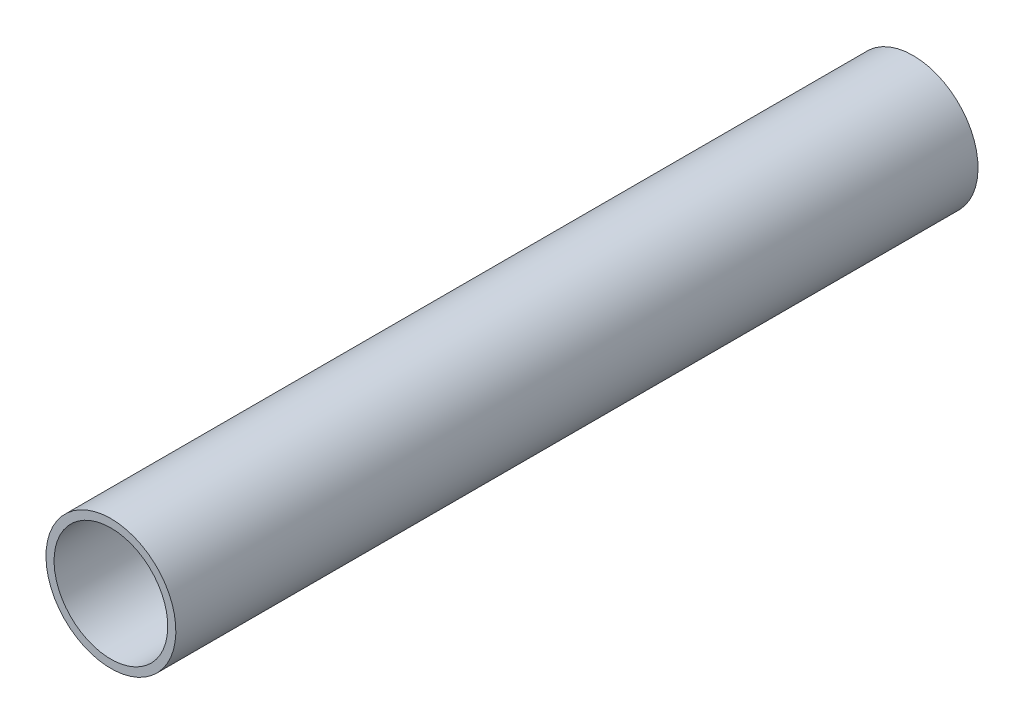
ISO-10303-21;
HEADER;
FILE_DESCRIPTION(('STEP AP214'),'2;1');
FILE_NAME('part.step','',(''),(''),'','','');
FILE_SCHEMA(('AUTOMOTIVE_DESIGN { 1 0 10303 214 1 1 1 1 }'));
ENDSEC;
DATA;
#1=APPLICATION_CONTEXT('core data for automotive mechanical design processes');
#2=APPLICATION_PROTOCOL_DEFINITION('international standard','automotive_design',2000,#1);
#3=PRODUCT_CONTEXT('',#1,'mechanical');
#4=PRODUCT('Part','Part','',(#3));
#5=PRODUCT_RELATED_PRODUCT_CATEGORY('part','',(#4));
#6=PRODUCT_DEFINITION_FORMATION('','',#4);
#7=PRODUCT_DEFINITION_CONTEXT('part definition',#1,'design');
#8=PRODUCT_DEFINITION('design','',#6,#7);
#9=PRODUCT_DEFINITION_SHAPE('','',#8);
#10=(LENGTH_UNIT() NAMED_UNIT(*) SI_UNIT(.MILLI.,.METRE.));
#11=(NAMED_UNIT(*) PLANE_ANGLE_UNIT() SI_UNIT($,.RADIAN.));
#12=(NAMED_UNIT(*) SI_UNIT($,.STERADIAN.) SOLID_ANGLE_UNIT());
#13=UNCERTAINTY_MEASURE_WITH_UNIT(LENGTH_MEASURE(1.E-05),#10,'distance_accuracy_value','');
#14=(GEOMETRIC_REPRESENTATION_CONTEXT(3) GLOBAL_UNCERTAINTY_ASSIGNED_CONTEXT((#13)) GLOBAL_UNIT_ASSIGNED_CONTEXT((#10,
#11,#12)) REPRESENTATION_CONTEXT('',''));
#15=CARTESIAN_POINT('',(0.,0.,0.));
#16=DIRECTION('',(0.,0.,1.));
#17=DIRECTION('',(1.,0.,0.));
#18=AXIS2_PLACEMENT_3D('',#15,#16,#17);
#19=CARTESIAN_POINT('',(0.,141.732,1000.));
#20=DIRECTION('',(0.,0.,1.));
#21=DIRECTION('',(0.,-1.,0.));
#22=AXIS2_PLACEMENT_3D('',#19,#20,#21);
#23=PLANE('',#22);
#24=CARTESIAN_POINT('',(0.,-1.27819932058934E-13,1000.));
#25=DIRECTION('',(0.,0.,-1.));
#26=DIRECTION('',(0.,1.,0.));
#27=AXIS2_PLACEMENT_3D('',#24,#25,#26);
#28=CIRCLE('',#27,141.732);
#29=CARTESIAN_POINT('',(0.,141.732,1000.));
#30=VERTEX_POINT('',#29);
#31=EDGE_CURVE('E52',#30,#30,#28,.T.);
#32=ORIENTED_EDGE('',*,*,#31,.T.);
#33=EDGE_LOOP('',(#32));
#34=FACE_BOUND('',#33,.T.);
#35=CARTESIAN_POINT('',(0.,-1.27819932058934E-13,1000.));
#36=DIRECTION('',(0.,0.,-1.));
#37=DIRECTION('',(0.,1.,0.));
#38=AXIS2_PLACEMENT_3D('',#35,#36,#37);
#39=CIRCLE('',#38,161.925);
#40=CARTESIAN_POINT('',(0.,161.925,1000.));
#41=VERTEX_POINT('',#40);
#42=EDGE_CURVE('E10',#41,#41,#39,.T.);
#43=ORIENTED_EDGE('',*,*,#42,.F.);
#44=EDGE_LOOP('',(#43));
#45=FACE_BOUND('',#44,.T.);
#46=ADVANCED_FACE('F38',(#34,#45),#23,.T.);
#47=CARTESIAN_POINT('',(0.,0.,-17.9701116569837));
#48=DIRECTION('',(0.,0.,-1.));
#49=DIRECTION('',(0.,1.,0.));
#50=AXIS2_PLACEMENT_3D('',#47,#48,#49);
#51=CYLINDRICAL_SURFACE('',#50,161.925);
#52=ORIENTED_EDGE('',*,*,#42,.T.);
#53=EDGE_LOOP('',(#52));
#54=FACE_BOUND('',#53,.T.);
#55=CARTESIAN_POINT('',(0.,1.23307150347989E-13,-1000.));
#56=DIRECTION('',(0.,0.,-1.));
#57=DIRECTION('',(0.,1.,0.));
#58=AXIS2_PLACEMENT_3D('',#55,#56,#57);
#59=CIRCLE('',#58,161.925);
#60=CARTESIAN_POINT('',(0.,161.925,-1000.));
#61=VERTEX_POINT('',#60);
#62=EDGE_CURVE('E44',#61,#61,#59,.T.);
#63=ORIENTED_EDGE('',*,*,#62,.F.);
#64=EDGE_LOOP('',(#63));
#65=FACE_BOUND('',#64,.T.);
#66=ADVANCED_FACE('F68',(#54,#65),#51,.T.);
#67=CARTESIAN_POINT('',(0.,141.732,-1000.));
#68=DIRECTION('',(0.,0.,-1.));
#69=DIRECTION('',(0.,1.,0.));
#70=AXIS2_PLACEMENT_3D('',#67,#68,#69);
#71=PLANE('',#70);
#72=ORIENTED_EDGE('',*,*,#62,.T.);
#73=EDGE_LOOP('',(#72));
#74=FACE_BOUND('',#73,.T.);
#75=CARTESIAN_POINT('',(0.,1.23307150347989E-13,-1000.));
#76=DIRECTION('',(0.,0.,-1.));
#77=DIRECTION('',(0.,1.,0.));
#78=AXIS2_PLACEMENT_3D('',#75,#76,#77);
#79=CIRCLE('',#78,141.732);
#80=CARTESIAN_POINT('',(0.,141.732,-1000.));
#81=VERTEX_POINT('',#80);
#82=EDGE_CURVE('E48',#81,#81,#79,.T.);
#83=ORIENTED_EDGE('',*,*,#82,.F.);
#84=EDGE_LOOP('',(#83));
#85=FACE_BOUND('',#84,.T.);
#86=ADVANCED_FACE('F62',(#74,#85),#71,.T.);
#87=CARTESIAN_POINT('',(0.,0.,-17.9701116569837));
#88=DIRECTION('',(0.,0.,-1.));
#89=DIRECTION('',(0.,1.,0.));
#90=AXIS2_PLACEMENT_3D('',#87,#88,#89);
#91=CYLINDRICAL_SURFACE('',#90,141.732);
#92=ORIENTED_EDGE('',*,*,#82,.T.);
#93=EDGE_LOOP('',(#92));
#94=FACE_BOUND('',#93,.T.);
#95=ORIENTED_EDGE('',*,*,#31,.F.);
#96=EDGE_LOOP('',(#95));
#97=FACE_BOUND('',#96,.T.);
#98=ADVANCED_FACE('F60',(#94,#97),#91,.F.);
#99=CLOSED_SHELL('',(#46,#66,#86,#98));
#100=MANIFOLD_SOLID_BREP('B2',#99);
#101=ADVANCED_BREP_SHAPE_REPRESENTATION('',(#18,#100),#14);
#102=SHAPE_DEFINITION_REPRESENTATION(#9,#101);
ENDSEC;
END-ISO-10303-21;
